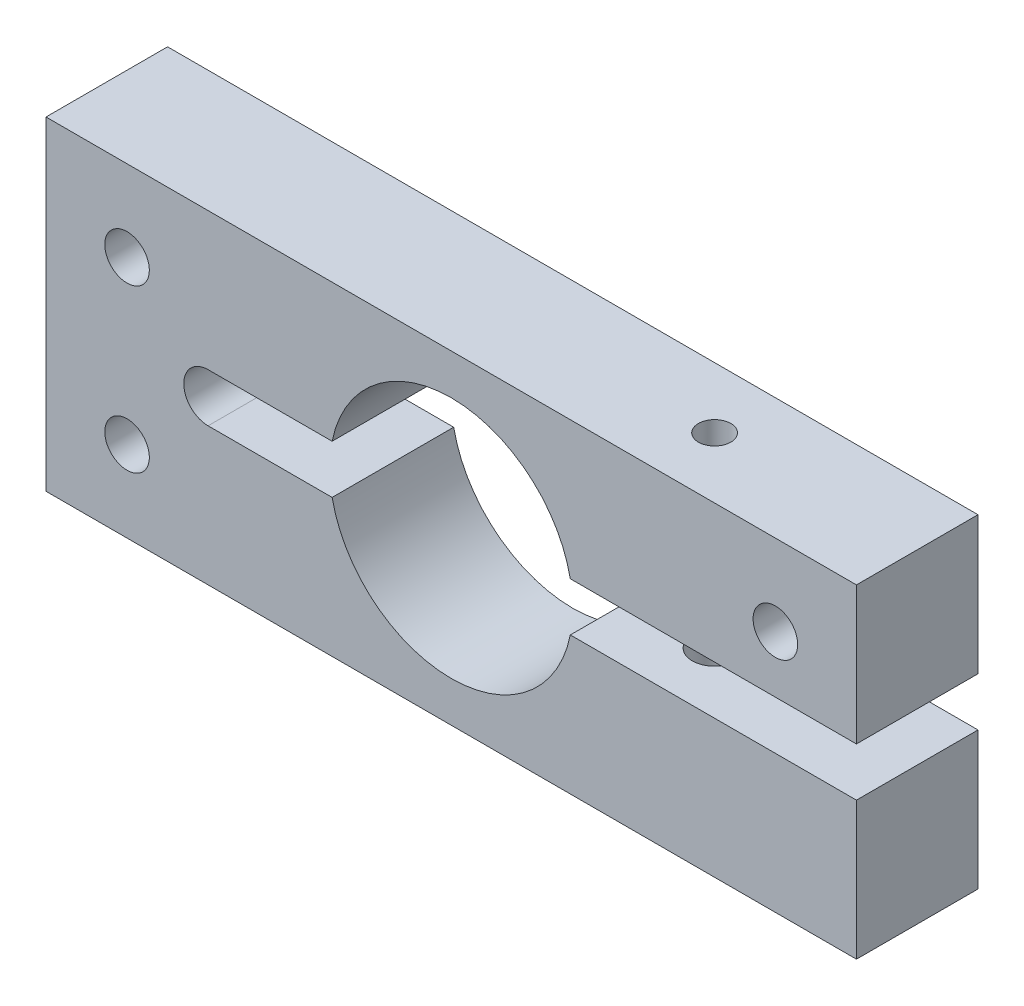
ISO-10303-21;
HEADER;
FILE_DESCRIPTION(('STEP AP214'),'2;1');
FILE_NAME('part.step','',(''),(''),'','','');
FILE_SCHEMA(('AUTOMOTIVE_DESIGN { 1 0 10303 214 1 1 1 1 }'));
ENDSEC;
DATA;
#1=APPLICATION_CONTEXT('core data for automotive mechanical design processes');
#2=APPLICATION_PROTOCOL_DEFINITION('international standard','automotive_design',2000,#1);
#3=PRODUCT_CONTEXT('',#1,'mechanical');
#4=PRODUCT('Part','Part','',(#3));
#5=PRODUCT_RELATED_PRODUCT_CATEGORY('part','',(#4));
#6=PRODUCT_DEFINITION_FORMATION('','',#4);
#7=PRODUCT_DEFINITION_CONTEXT('part definition',#1,'design');
#8=PRODUCT_DEFINITION('design','',#6,#7);
#9=PRODUCT_DEFINITION_SHAPE('','',#8);
#10=(LENGTH_UNIT() NAMED_UNIT(*) SI_UNIT(.MILLI.,.METRE.));
#11=(NAMED_UNIT(*) PLANE_ANGLE_UNIT() SI_UNIT($,.RADIAN.));
#12=(NAMED_UNIT(*) SI_UNIT($,.STERADIAN.) SOLID_ANGLE_UNIT());
#13=UNCERTAINTY_MEASURE_WITH_UNIT(LENGTH_MEASURE(1.E-05),#10,'distance_accuracy_value','');
#14=(GEOMETRIC_REPRESENTATION_CONTEXT(3) GLOBAL_UNCERTAINTY_ASSIGNED_CONTEXT((#13)) GLOBAL_UNIT_ASSIGNED_CONTEXT((#10,
#11,#12)) REPRESENTATION_CONTEXT('',''));
#15=CARTESIAN_POINT('',(0.,0.,0.));
#16=DIRECTION('',(0.,0.,1.));
#17=DIRECTION('',(1.,0.,0.));
#18=AXIS2_PLACEMENT_3D('',#15,#16,#17);
#19=CARTESIAN_POINT('',(50.,20.,0.));
#20=DIRECTION('',(0.,0.,1.));
#21=DIRECTION('',(1.,0.,0.));
#22=AXIS2_PLACEMENT_3D('',#19,#20,#21);
#23=PLANE('',#22);
#24=CARTESIAN_POINT('',(10.,30.,0.));
#25=DIRECTION('',(0.,0.,1.));
#26=DIRECTION('',(-1.,0.,0.));
#27=AXIS2_PLACEMENT_3D('',#24,#25,#26);
#28=CIRCLE('',#27,4.5);
#29=CARTESIAN_POINT('',(5.5,30.,0.));
#30=VERTEX_POINT('',#29);
#31=EDGE_CURVE('E221',#30,#30,#28,.T.);
#32=ORIENTED_EDGE('',*,*,#31,.T.);
#33=EDGE_LOOP('',(#32));
#34=FACE_BOUND('',#33,.T.);
#35=DIRECTION('',(0.,-1.,0.));
#36=VECTOR('',#35,1.);
#37=CARTESIAN_POINT('',(0.,0.,0.));
#38=LINE('',#37,#36);
#39=CARTESIAN_POINT('',(0.,40.,0.));
#40=VERTEX_POINT('',#39);
#41=CARTESIAN_POINT('',(0.,0.,0.));
#42=VERTEX_POINT('',#41);
#43=EDGE_CURVE('E161',#40,#42,#38,.T.);
#44=ORIENTED_EDGE('',*,*,#43,.F.);
#45=DIRECTION('',(-1.,0.,0.));
#46=VECTOR('',#45,1.);
#47=CARTESIAN_POINT('',(0.,40.,0.));
#48=LINE('',#47,#46);
#49=CARTESIAN_POINT('',(100.,40.,0.));
#50=VERTEX_POINT('',#49);
#51=EDGE_CURVE('E103',#50,#40,#48,.T.);
#52=ORIENTED_EDGE('',*,*,#51,.F.);
#53=DIRECTION('',(0.,1.,0.));
#54=VECTOR('',#53,1.);
#55=CARTESIAN_POINT('',(100.,23.,0.));
#56=LINE('',#55,#54);
#57=CARTESIAN_POINT('',(100.,23.,0.));
#58=VERTEX_POINT('',#57);
#59=EDGE_CURVE('E97',#58,#50,#56,.T.);
#60=ORIENTED_EDGE('',*,*,#59,.F.);
#61=DIRECTION('',(1.,0.,0.));
#62=VECTOR('',#61,1.);
#63=CARTESIAN_POINT('',(64.6969384566991,23.,0.));
#64=LINE('',#63,#62);
#65=CARTESIAN_POINT('',(64.6969384566991,23.,0.));
#66=VERTEX_POINT('',#65);
#67=EDGE_CURVE('E151',#66,#58,#64,.T.);
#68=ORIENTED_EDGE('',*,*,#67,.F.);
#69=CARTESIAN_POINT('',(50.,20.,0.));
#70=DIRECTION('',(0.,0.,-1.));
#71=DIRECTION('',(1.,0.,0.));
#72=AXIS2_PLACEMENT_3D('',#69,#70,#71);
#73=CIRCLE('',#72,15.);
#74=CARTESIAN_POINT('',(35.3030615433009,23.,0.));
#75=VERTEX_POINT('',#74);
#76=EDGE_CURVE('E179',#75,#66,#73,.T.);
#77=ORIENTED_EDGE('',*,*,#76,.F.);
#78=DIRECTION('',(1.,0.,0.));
#79=VECTOR('',#78,1.);
#80=CARTESIAN_POINT('',(20.,23.,0.));
#81=LINE('',#80,#79);
#82=CARTESIAN_POINT('',(20.,23.,0.));
#83=VERTEX_POINT('',#82);
#84=EDGE_CURVE('E177',#83,#75,#81,.T.);
#85=ORIENTED_EDGE('',*,*,#84,.F.);
#86=CARTESIAN_POINT('',(20.,20.,0.));
#87=DIRECTION('',(0.,0.,-1.));
#88=DIRECTION('',(1.,0.,0.));
#89=AXIS2_PLACEMENT_3D('',#86,#87,#88);
#90=CIRCLE('',#89,3.);
#91=CARTESIAN_POINT('',(20.,17.,0.));
#92=VERTEX_POINT('',#91);
#93=EDGE_CURVE('E175',#92,#83,#90,.T.);
#94=ORIENTED_EDGE('',*,*,#93,.F.);
#95=DIRECTION('',(-1.,0.,0.));
#96=VECTOR('',#95,1.);
#97=CARTESIAN_POINT('',(20.,17.,0.));
#98=LINE('',#97,#96);
#99=CARTESIAN_POINT('',(35.3030615433009,17.,0.));
#100=VERTEX_POINT('',#99);
#101=EDGE_CURVE('E173',#100,#92,#98,.T.);
#102=ORIENTED_EDGE('',*,*,#101,.F.);
#103=CARTESIAN_POINT('',(50.,20.,0.));
#104=DIRECTION('',(0.,0.,-1.));
#105=DIRECTION('',(1.,0.,0.));
#106=AXIS2_PLACEMENT_3D('',#103,#104,#105);
#107=CIRCLE('',#106,15.);
#108=CARTESIAN_POINT('',(64.6969384566991,17.,0.));
#109=VERTEX_POINT('',#108);
#110=EDGE_CURVE('E171',#109,#100,#107,.T.);
#111=ORIENTED_EDGE('',*,*,#110,.F.);
#112=DIRECTION('',(-1.,0.,0.));
#113=VECTOR('',#112,1.);
#114=CARTESIAN_POINT('',(64.6969384566991,17.,0.));
#115=LINE('',#114,#113);
#116=CARTESIAN_POINT('',(100.,17.,0.));
#117=VERTEX_POINT('',#116);
#118=EDGE_CURVE('E169',#117,#109,#115,.T.);
#119=ORIENTED_EDGE('',*,*,#118,.F.);
#120=DIRECTION('',(0.,1.,0.));
#121=VECTOR('',#120,1.);
#122=CARTESIAN_POINT('',(100.,0.,0.));
#123=LINE('',#122,#121);
#124=CARTESIAN_POINT('',(100.,0.,0.));
#125=VERTEX_POINT('',#124);
#126=EDGE_CURVE('E167',#125,#117,#123,.T.);
#127=ORIENTED_EDGE('',*,*,#126,.F.);
#128=DIRECTION('',(1.,0.,0.));
#129=VECTOR('',#128,1.);
#130=CARTESIAN_POINT('',(0.,0.,0.));
#131=LINE('',#130,#129);
#132=EDGE_CURVE('E164',#42,#125,#131,.T.);
#133=ORIENTED_EDGE('',*,*,#132,.F.);
#134=EDGE_LOOP('',(#44,#52,#60,#68,#77,#85,#94,#102,#111,#119,#127,#133));
#135=FACE_BOUND('',#134,.T.);
#136=CARTESIAN_POINT('',(10.,10.,0.));
#137=DIRECTION('',(0.,0.,1.));
#138=DIRECTION('',(1.,0.,0.));
#139=AXIS2_PLACEMENT_3D('',#136,#137,#138);
#140=CIRCLE('',#139,4.5);
#141=CARTESIAN_POINT('',(14.5,10.,0.));
#142=VERTEX_POINT('',#141);
#143=EDGE_CURVE('E214',#142,#142,#140,.T.);
#144=ORIENTED_EDGE('',*,*,#143,.T.);
#145=EDGE_LOOP('',(#144));
#146=FACE_BOUND('',#145,.T.);
#147=CARTESIAN_POINT('',(90.,30.,0.));
#148=DIRECTION('',(0.,0.,1.));
#149=DIRECTION('',(1.,0.,0.));
#150=AXIS2_PLACEMENT_3D('',#147,#148,#149);
#151=CIRCLE('',#150,4.49999999999999);
#152=CARTESIAN_POINT('',(94.5,30.,0.));
#153=VERTEX_POINT('',#152);
#154=EDGE_CURVE('E228',#153,#153,#151,.T.);
#155=ORIENTED_EDGE('',*,*,#154,.T.);
#156=EDGE_LOOP('',(#155));
#157=FACE_BOUND('',#156,.T.);
#158=ADVANCED_FACE('F37',(#34,#135,#146,#157),#23,.F.);
#159=CARTESIAN_POINT('',(10.,30.,15.));
#160=DIRECTION('',(0.,0.,-1.));
#161=DIRECTION('',(-1.,0.,0.));
#162=AXIS2_PLACEMENT_3D('',#159,#160,#161);
#163=CYLINDRICAL_SURFACE('',#162,2.75);
#164=CARTESIAN_POINT('',(10.,30.,15.));
#165=DIRECTION('',(0.,0.,1.));
#166=DIRECTION('',(1.,0.,0.));
#167=AXIS2_PLACEMENT_3D('',#164,#165,#166);
#168=CIRCLE('',#167,2.75);
#169=CARTESIAN_POINT('',(12.75,30.,15.));
#170=VERTEX_POINT('',#169);
#171=EDGE_CURVE('E165',#170,#170,#168,.T.);
#172=ORIENTED_EDGE('',*,*,#171,.T.);
#173=EDGE_LOOP('',(#172));
#174=FACE_BOUND('',#173,.T.);
#175=CARTESIAN_POINT('',(10.,30.,5.));
#176=DIRECTION('',(0.,0.,-1.));
#177=DIRECTION('',(-1.,0.,0.));
#178=AXIS2_PLACEMENT_3D('',#175,#176,#177);
#179=CIRCLE('',#178,2.75);
#180=CARTESIAN_POINT('',(7.25,30.,5.));
#181=VERTEX_POINT('',#180);
#182=EDGE_CURVE('E212',#181,#181,#179,.T.);
#183=ORIENTED_EDGE('',*,*,#182,.T.);
#184=EDGE_LOOP('',(#183));
#185=FACE_BOUND('',#184,.T.);
#186=ADVANCED_FACE('F297',(#174,#185),#163,.F.);
#187=CARTESIAN_POINT('',(50.,20.,15.));
#188=DIRECTION('',(0.,0.,1.));
#189=DIRECTION('',(1.,0.,0.));
#190=AXIS2_PLACEMENT_3D('',#187,#188,#189);
#191=PLANE('',#190);
#192=CARTESIAN_POINT('',(10.,10.,15.));
#193=DIRECTION('',(0.,0.,1.));
#194=DIRECTION('',(-1.,0.,0.));
#195=AXIS2_PLACEMENT_3D('',#192,#193,#194);
#196=CIRCLE('',#195,2.75);
#197=CARTESIAN_POINT('',(7.25,10.,15.));
#198=VERTEX_POINT('',#197);
#199=EDGE_CURVE('E247',#198,#198,#196,.T.);
#200=ORIENTED_EDGE('',*,*,#199,.F.);
#201=EDGE_LOOP('',(#200));
#202=FACE_BOUND('',#201,.T.);
#203=DIRECTION('',(0.,-1.,0.));
#204=VECTOR('',#203,1.);
#205=CARTESIAN_POINT('',(0.,0.,15.));
#206=LINE('',#205,#204);
#207=CARTESIAN_POINT('',(0.,40.,15.));
#208=VERTEX_POINT('',#207);
#209=CARTESIAN_POINT('',(0.,0.,15.));
#210=VERTEX_POINT('',#209);
#211=EDGE_CURVE('E184',#208,#210,#206,.T.);
#212=ORIENTED_EDGE('',*,*,#211,.T.);
#213=DIRECTION('',(1.,0.,0.));
#214=VECTOR('',#213,1.);
#215=CARTESIAN_POINT('',(0.,0.,15.));
#216=LINE('',#215,#214);
#217=CARTESIAN_POINT('',(100.,0.,15.));
#218=VERTEX_POINT('',#217);
#219=EDGE_CURVE('E111',#210,#218,#216,.T.);
#220=ORIENTED_EDGE('',*,*,#219,.T.);
#221=DIRECTION('',(0.,1.,0.));
#222=VECTOR('',#221,1.);
#223=CARTESIAN_POINT('',(100.,0.,15.));
#224=LINE('',#223,#222);
#225=CARTESIAN_POINT('',(100.,17.,15.));
#226=VERTEX_POINT('',#225);
#227=EDGE_CURVE('E254',#218,#226,#224,.T.);
#228=ORIENTED_EDGE('',*,*,#227,.T.);
#229=DIRECTION('',(-1.,0.,0.));
#230=VECTOR('',#229,1.);
#231=CARTESIAN_POINT('',(64.6969384566991,17.,15.));
#232=LINE('',#231,#230);
#233=CARTESIAN_POINT('',(64.6969384566991,17.,15.));
#234=VERTEX_POINT('',#233);
#235=EDGE_CURVE('E256',#226,#234,#232,.T.);
#236=ORIENTED_EDGE('',*,*,#235,.T.);
#237=CARTESIAN_POINT('',(50.,20.,15.));
#238=DIRECTION('',(0.,0.,-1.));
#239=DIRECTION('',(1.,0.,0.));
#240=AXIS2_PLACEMENT_3D('',#237,#238,#239);
#241=CIRCLE('',#240,15.);
#242=CARTESIAN_POINT('',(35.3030615433009,17.,15.));
#243=VERTEX_POINT('',#242);
#244=EDGE_CURVE('E258',#234,#243,#241,.T.);
#245=ORIENTED_EDGE('',*,*,#244,.T.);
#246=DIRECTION('',(-1.,0.,0.));
#247=VECTOR('',#246,1.);
#248=CARTESIAN_POINT('',(20.,17.,15.));
#249=LINE('',#248,#247);
#250=CARTESIAN_POINT('',(20.,17.,15.));
#251=VERTEX_POINT('',#250);
#252=EDGE_CURVE('E260',#243,#251,#249,.T.);
#253=ORIENTED_EDGE('',*,*,#252,.T.);
#254=CARTESIAN_POINT('',(20.,20.,15.));
#255=DIRECTION('',(0.,0.,-1.));
#256=DIRECTION('',(1.,0.,0.));
#257=AXIS2_PLACEMENT_3D('',#254,#255,#256);
#258=CIRCLE('',#257,3.);
#259=CARTESIAN_POINT('',(20.,23.,15.));
#260=VERTEX_POINT('',#259);
#261=EDGE_CURVE('E262',#251,#260,#258,.T.);
#262=ORIENTED_EDGE('',*,*,#261,.T.);
#263=DIRECTION('',(1.,0.,0.));
#264=VECTOR('',#263,1.);
#265=CARTESIAN_POINT('',(20.,23.,15.));
#266=LINE('',#265,#264);
#267=CARTESIAN_POINT('',(35.3030615433009,23.,15.));
#268=VERTEX_POINT('',#267);
#269=EDGE_CURVE('E264',#260,#268,#266,.T.);
#270=ORIENTED_EDGE('',*,*,#269,.T.);
#271=CARTESIAN_POINT('',(50.,20.,15.));
#272=DIRECTION('',(0.,0.,-1.));
#273=DIRECTION('',(1.,0.,0.));
#274=AXIS2_PLACEMENT_3D('',#271,#272,#273);
#275=CIRCLE('',#274,15.);
#276=CARTESIAN_POINT('',(64.6969384566991,23.,15.));
#277=VERTEX_POINT('',#276);
#278=EDGE_CURVE('E143',#268,#277,#275,.T.);
#279=ORIENTED_EDGE('',*,*,#278,.T.);
#280=DIRECTION('',(1.,0.,0.));
#281=VECTOR('',#280,1.);
#282=CARTESIAN_POINT('',(64.6969384566991,23.,15.));
#283=LINE('',#282,#281);
#284=CARTESIAN_POINT('',(100.,23.,15.));
#285=VERTEX_POINT('',#284);
#286=EDGE_CURVE('E136',#277,#285,#283,.T.);
#287=ORIENTED_EDGE('',*,*,#286,.T.);
#288=DIRECTION('',(0.,1.,0.));
#289=VECTOR('',#288,1.);
#290=CARTESIAN_POINT('',(100.,23.,15.));
#291=LINE('',#290,#289);
#292=CARTESIAN_POINT('',(100.,40.,15.));
#293=VERTEX_POINT('',#292);
#294=EDGE_CURVE('E141',#285,#293,#291,.T.);
#295=ORIENTED_EDGE('',*,*,#294,.T.);
#296=DIRECTION('',(-1.,0.,0.));
#297=VECTOR('',#296,1.);
#298=CARTESIAN_POINT('',(0.,40.,15.));
#299=LINE('',#298,#297);
#300=EDGE_CURVE('E56',#293,#208,#299,.T.);
#301=ORIENTED_EDGE('',*,*,#300,.T.);
#302=EDGE_LOOP('',(#212,#220,#228,#236,#245,#253,#262,#270,#279,#287,#295,#301));
#303=FACE_BOUND('',#302,.T.);
#304=ORIENTED_EDGE('',*,*,#171,.F.);
#305=EDGE_LOOP('',(#304));
#306=FACE_BOUND('',#305,.T.);
#307=CARTESIAN_POINT('',(90.,30.,15.));
#308=DIRECTION('',(0.,0.,1.));
#309=DIRECTION('',(-1.,0.,0.));
#310=AXIS2_PLACEMENT_3D('',#307,#308,#309);
#311=CIRCLE('',#310,2.74999999999999);
#312=CARTESIAN_POINT('',(87.25,30.,15.));
#313=VERTEX_POINT('',#312);
#314=EDGE_CURVE('E244',#313,#313,#311,.T.);
#315=ORIENTED_EDGE('',*,*,#314,.F.);
#316=EDGE_LOOP('',(#315));
#317=FACE_BOUND('',#316,.T.);
#318=ADVANCED_FACE('F138',(#202,#303,#306,#317),#191,.T.);
#319=CARTESIAN_POINT('',(0.,0.,15.));
#320=DIRECTION('',(1.,0.,0.));
#321=DIRECTION('',(0.,0.,-1.));
#322=AXIS2_PLACEMENT_3D('',#319,#320,#321);
#323=PLANE('',#322);
#324=ORIENTED_EDGE('',*,*,#43,.T.);
#325=DIRECTION('',(0.,0.,-1.));
#326=VECTOR('',#325,1.);
#327=CARTESIAN_POINT('',(0.,0.,15.));
#328=LINE('',#327,#326);
#329=EDGE_CURVE('E11',#210,#42,#328,.T.);
#330=ORIENTED_EDGE('',*,*,#329,.F.);
#331=ORIENTED_EDGE('',*,*,#211,.F.);
#332=DIRECTION('',(0.,0.,-1.));
#333=VECTOR('',#332,1.);
#334=CARTESIAN_POINT('',(0.,40.,15.));
#335=LINE('',#334,#333);
#336=EDGE_CURVE('E157',#208,#40,#335,.T.);
#337=ORIENTED_EDGE('',*,*,#336,.T.);
#338=EDGE_LOOP('',(#324,#330,#331,#337));
#339=FACE_BOUND('',#338,.T.);
#340=ADVANCED_FACE('F39',(#339),#323,.F.);
#341=CARTESIAN_POINT('',(0.,0.,15.));
#342=DIRECTION('',(0.,1.,0.));
#343=DIRECTION('',(0.,0.,1.));
#344=AXIS2_PLACEMENT_3D('',#341,#342,#343);
#345=PLANE('',#344);
#346=CARTESIAN_POINT('',(75.,0.,7.5));
#347=DIRECTION('',(0.,-1.,0.));
#348=DIRECTION('',(0.,0.,-1.));
#349=AXIS2_PLACEMENT_3D('',#346,#347,#348);
#350=CIRCLE('',#349,4.5);
#351=CARTESIAN_POINT('',(75.,0.,2.99999999999999));
#352=VERTEX_POINT('',#351);
#353=EDGE_CURVE('E210',#352,#352,#350,.T.);
#354=ORIENTED_EDGE('',*,*,#353,.F.);
#355=EDGE_LOOP('',(#354));
#356=FACE_BOUND('',#355,.T.);
#357=ORIENTED_EDGE('',*,*,#132,.T.);
#358=DIRECTION('',(0.,0.,-1.));
#359=VECTOR('',#358,1.);
#360=CARTESIAN_POINT('',(100.,0.,15.));
#361=LINE('',#360,#359);
#362=EDGE_CURVE('E47',#218,#125,#361,.T.);
#363=ORIENTED_EDGE('',*,*,#362,.F.);
#364=ORIENTED_EDGE('',*,*,#219,.F.);
#365=ORIENTED_EDGE('',*,*,#329,.T.);
#366=EDGE_LOOP('',(#357,#363,#364,#365));
#367=FACE_BOUND('',#366,.T.);
#368=ADVANCED_FACE('F409',(#356,#367),#345,.F.);
#369=CARTESIAN_POINT('',(100.,0.,15.));
#370=DIRECTION('',(-1.,0.,0.));
#371=DIRECTION('',(0.,0.,1.));
#372=AXIS2_PLACEMENT_3D('',#369,#370,#371);
#373=PLANE('',#372);
#374=ORIENTED_EDGE('',*,*,#126,.T.);
#375=DIRECTION('',(0.,0.,-1.));
#376=VECTOR('',#375,1.);
#377=CARTESIAN_POINT('',(100.,17.,15.));
#378=LINE('',#377,#376);
#379=EDGE_CURVE('E203',#226,#117,#378,.T.);
#380=ORIENTED_EDGE('',*,*,#379,.F.);
#381=ORIENTED_EDGE('',*,*,#227,.F.);
#382=ORIENTED_EDGE('',*,*,#362,.T.);
#383=EDGE_LOOP('',(#374,#380,#381,#382));
#384=FACE_BOUND('',#383,.T.);
#385=ADVANCED_FACE('F378',(#384),#373,.F.);
#386=CARTESIAN_POINT('',(64.6969384566991,17.,15.));
#387=DIRECTION('',(0.,-1.,0.));
#388=DIRECTION('',(0.,0.,-1.));
#389=AXIS2_PLACEMENT_3D('',#386,#387,#388);
#390=PLANE('',#389);
#391=CARTESIAN_POINT('',(75.,17.,7.5));
#392=DIRECTION('',(0.,-1.,0.));
#393=DIRECTION('',(0.,0.,-1.));
#394=AXIS2_PLACEMENT_3D('',#391,#392,#393);
#395=CIRCLE('',#394,2.75000000000001);
#396=CARTESIAN_POINT('',(75.,17.,4.74999999999999));
#397=VERTEX_POINT('',#396);
#398=EDGE_CURVE('E357',#397,#397,#395,.F.);
#399=ORIENTED_EDGE('',*,*,#398,.F.);
#400=EDGE_LOOP('',(#399));
#401=FACE_BOUND('',#400,.T.);
#402=ORIENTED_EDGE('',*,*,#118,.T.);
#403=DIRECTION('',(0.,0.,-1.));
#404=VECTOR('',#403,1.);
#405=CARTESIAN_POINT('',(64.6969384566991,17.,15.));
#406=LINE('',#405,#404);
#407=EDGE_CURVE('E200',#234,#109,#406,.T.);
#408=ORIENTED_EDGE('',*,*,#407,.F.);
#409=ORIENTED_EDGE('',*,*,#235,.F.);
#410=ORIENTED_EDGE('',*,*,#379,.T.);
#411=EDGE_LOOP('',(#402,#408,#409,#410));
#412=FACE_BOUND('',#411,.T.);
#413=ADVANCED_FACE('F374',(#401,#412),#390,.F.);
#414=CARTESIAN_POINT('',(50.,20.,15.));
#415=DIRECTION('',(0.,0.,-1.));
#416=DIRECTION('',(-1.,0.,0.));
#417=AXIS2_PLACEMENT_3D('',#414,#415,#416);
#418=CYLINDRICAL_SURFACE('',#417,15.);
#419=ORIENTED_EDGE('',*,*,#110,.T.);
#420=DIRECTION('',(0.,0.,-1.));
#421=VECTOR('',#420,1.);
#422=CARTESIAN_POINT('',(35.3030615433009,17.,15.));
#423=LINE('',#422,#421);
#424=EDGE_CURVE('E197',#243,#100,#423,.T.);
#425=ORIENTED_EDGE('',*,*,#424,.F.);
#426=ORIENTED_EDGE('',*,*,#244,.F.);
#427=ORIENTED_EDGE('',*,*,#407,.T.);
#428=EDGE_LOOP('',(#419,#425,#426,#427));
#429=FACE_BOUND('',#428,.T.);
#430=ADVANCED_FACE('F377',(#429),#418,.F.);
#431=CARTESIAN_POINT('',(20.,17.,15.));
#432=DIRECTION('',(0.,-1.,0.));
#433=DIRECTION('',(0.,0.,-1.));
#434=AXIS2_PLACEMENT_3D('',#431,#432,#433);
#435=PLANE('',#434);
#436=ORIENTED_EDGE('',*,*,#101,.T.);
#437=DIRECTION('',(0.,0.,-1.));
#438=VECTOR('',#437,1.);
#439=CARTESIAN_POINT('',(20.,17.,15.));
#440=LINE('',#439,#438);
#441=EDGE_CURVE('E194',#251,#92,#440,.T.);
#442=ORIENTED_EDGE('',*,*,#441,.F.);
#443=ORIENTED_EDGE('',*,*,#252,.F.);
#444=ORIENTED_EDGE('',*,*,#424,.T.);
#445=EDGE_LOOP('',(#436,#442,#443,#444));
#446=FACE_BOUND('',#445,.T.);
#447=ADVANCED_FACE('F392',(#446),#435,.F.);
#448=CARTESIAN_POINT('',(20.,20.,15.));
#449=DIRECTION('',(0.,0.,-1.));
#450=DIRECTION('',(-1.,0.,0.));
#451=AXIS2_PLACEMENT_3D('',#448,#449,#450);
#452=CYLINDRICAL_SURFACE('',#451,3.);
#453=ORIENTED_EDGE('',*,*,#93,.T.);
#454=DIRECTION('',(0.,0.,-1.));
#455=VECTOR('',#454,1.);
#456=CARTESIAN_POINT('',(20.,23.,15.));
#457=LINE('',#456,#455);
#458=EDGE_CURVE('E191',#260,#83,#457,.T.);
#459=ORIENTED_EDGE('',*,*,#458,.F.);
#460=ORIENTED_EDGE('',*,*,#261,.F.);
#461=ORIENTED_EDGE('',*,*,#441,.T.);
#462=EDGE_LOOP('',(#453,#459,#460,#461));
#463=FACE_BOUND('',#462,.T.);
#464=ADVANCED_FACE('F395',(#463),#452,.F.);
#465=CARTESIAN_POINT('',(20.,23.,15.));
#466=DIRECTION('',(0.,1.,0.));
#467=DIRECTION('',(0.,0.,1.));
#468=AXIS2_PLACEMENT_3D('',#465,#466,#467);
#469=PLANE('',#468);
#470=ORIENTED_EDGE('',*,*,#84,.T.);
#471=DIRECTION('',(0.,0.,-1.));
#472=VECTOR('',#471,1.);
#473=CARTESIAN_POINT('',(35.3030615433009,23.,15.));
#474=LINE('',#473,#472);
#475=EDGE_CURVE('E188',#268,#75,#474,.T.);
#476=ORIENTED_EDGE('',*,*,#475,.F.);
#477=ORIENTED_EDGE('',*,*,#269,.F.);
#478=ORIENTED_EDGE('',*,*,#458,.T.);
#479=EDGE_LOOP('',(#470,#476,#477,#478));
#480=FACE_BOUND('',#479,.T.);
#481=ADVANCED_FACE('F270',(#480),#469,.F.);
#482=CARTESIAN_POINT('',(50.,20.,15.));
#483=DIRECTION('',(0.,0.,-1.));
#484=DIRECTION('',(-1.,0.,0.));
#485=AXIS2_PLACEMENT_3D('',#482,#483,#484);
#486=CYLINDRICAL_SURFACE('',#485,15.);
#487=ORIENTED_EDGE('',*,*,#76,.T.);
#488=DIRECTION('',(0.,0.,-1.));
#489=VECTOR('',#488,1.);
#490=CARTESIAN_POINT('',(64.6969384566991,23.,15.));
#491=LINE('',#490,#489);
#492=EDGE_CURVE('E152',#277,#66,#491,.T.);
#493=ORIENTED_EDGE('',*,*,#492,.F.);
#494=ORIENTED_EDGE('',*,*,#278,.F.);
#495=ORIENTED_EDGE('',*,*,#475,.T.);
#496=EDGE_LOOP('',(#487,#493,#494,#495));
#497=FACE_BOUND('',#496,.T.);
#498=ADVANCED_FACE('F274',(#497),#486,.F.);
#499=CARTESIAN_POINT('',(64.6969384566991,23.,15.));
#500=DIRECTION('',(0.,1.,0.));
#501=DIRECTION('',(-1.,0.,0.));
#502=AXIS2_PLACEMENT_3D('',#499,#500,#501);
#503=PLANE('',#502);
#504=CARTESIAN_POINT('',(75.,23.,7.5));
#505=DIRECTION('',(0.,1.,0.));
#506=DIRECTION('',(-1.,0.,0.));
#507=AXIS2_PLACEMENT_3D('',#504,#505,#506);
#508=CIRCLE('',#507,2.);
#509=CARTESIAN_POINT('',(73.,23.,7.5));
#510=VERTEX_POINT('',#509);
#511=EDGE_CURVE('E241',#510,#510,#508,.T.);
#512=ORIENTED_EDGE('',*,*,#511,.T.);
#513=EDGE_LOOP('',(#512));
#514=FACE_BOUND('',#513,.T.);
#515=ORIENTED_EDGE('',*,*,#67,.T.);
#516=DIRECTION('',(0.,0.,-1.));
#517=VECTOR('',#516,1.);
#518=CARTESIAN_POINT('',(100.,23.,15.));
#519=LINE('',#518,#517);
#520=EDGE_CURVE('E148',#285,#58,#519,.T.);
#521=ORIENTED_EDGE('',*,*,#520,.F.);
#522=ORIENTED_EDGE('',*,*,#286,.F.);
#523=ORIENTED_EDGE('',*,*,#492,.T.);
#524=EDGE_LOOP('',(#515,#521,#522,#523));
#525=FACE_BOUND('',#524,.T.);
#526=ADVANCED_FACE('F149',(#514,#525),#503,.F.);
#527=CARTESIAN_POINT('',(100.,23.,15.));
#528=DIRECTION('',(-1.,0.,0.));
#529=DIRECTION('',(0.,0.,1.));
#530=AXIS2_PLACEMENT_3D('',#527,#528,#529);
#531=PLANE('',#530);
#532=ORIENTED_EDGE('',*,*,#59,.T.);
#533=DIRECTION('',(0.,0.,-1.));
#534=VECTOR('',#533,1.);
#535=CARTESIAN_POINT('',(100.,40.,15.));
#536=LINE('',#535,#534);
#537=EDGE_CURVE('E153',#293,#50,#536,.T.);
#538=ORIENTED_EDGE('',*,*,#537,.F.);
#539=ORIENTED_EDGE('',*,*,#294,.F.);
#540=ORIENTED_EDGE('',*,*,#520,.T.);
#541=EDGE_LOOP('',(#532,#538,#539,#540));
#542=FACE_BOUND('',#541,.T.);
#543=ADVANCED_FACE('F155',(#542),#531,.F.);
#544=CARTESIAN_POINT('',(0.,40.,15.));
#545=DIRECTION('',(0.,-1.,0.));
#546=DIRECTION('',(0.,0.,-1.));
#547=AXIS2_PLACEMENT_3D('',#544,#545,#546);
#548=PLANE('',#547);
#549=CARTESIAN_POINT('',(75.,40.,7.5));
#550=DIRECTION('',(0.,-1.,0.));
#551=DIRECTION('',(0.,0.,-1.));
#552=AXIS2_PLACEMENT_3D('',#549,#550,#551);
#553=CIRCLE('',#552,2.);
#554=CARTESIAN_POINT('',(75.,40.,5.5));
#555=VERTEX_POINT('',#554);
#556=EDGE_CURVE('E236',#555,#555,#553,.T.);
#557=ORIENTED_EDGE('',*,*,#556,.T.);
#558=EDGE_LOOP('',(#557));
#559=FACE_BOUND('',#558,.T.);
#560=ORIENTED_EDGE('',*,*,#51,.T.);
#561=ORIENTED_EDGE('',*,*,#336,.F.);
#562=ORIENTED_EDGE('',*,*,#300,.F.);
#563=ORIENTED_EDGE('',*,*,#537,.T.);
#564=EDGE_LOOP('',(#560,#561,#562,#563));
#565=FACE_BOUND('',#564,.T.);
#566=ADVANCED_FACE('F282',(#559,#565),#548,.F.);
#567=CARTESIAN_POINT('',(10.,10.,15.));
#568=DIRECTION('',(0.,0.,-1.));
#569=DIRECTION('',(-1.,0.,0.));
#570=AXIS2_PLACEMENT_3D('',#567,#568,#569);
#571=CYLINDRICAL_SURFACE('',#570,2.75);
#572=CARTESIAN_POINT('',(10.,10.,5.));
#573=DIRECTION('',(0.,0.,1.));
#574=DIRECTION('',(1.,0.,0.));
#575=AXIS2_PLACEMENT_3D('',#572,#573,#574);
#576=CIRCLE('',#575,2.75);
#577=CARTESIAN_POINT('',(12.75,10.,5.));
#578=VERTEX_POINT('',#577);
#579=EDGE_CURVE('E208',#578,#578,#576,.T.);
#580=ORIENTED_EDGE('',*,*,#579,.F.);
#581=EDGE_LOOP('',(#580));
#582=FACE_BOUND('',#581,.T.);
#583=ORIENTED_EDGE('',*,*,#199,.T.);
#584=EDGE_LOOP('',(#583));
#585=FACE_BOUND('',#584,.T.);
#586=ADVANCED_FACE('F284',(#582,#585),#571,.F.);
#587=CARTESIAN_POINT('',(90.,30.,15.));
#588=DIRECTION('',(0.,0.,-1.));
#589=DIRECTION('',(-1.,0.,0.));
#590=AXIS2_PLACEMENT_3D('',#587,#588,#589);
#591=CYLINDRICAL_SURFACE('',#590,2.74999999999999);
#592=CARTESIAN_POINT('',(90.,30.,5.));
#593=DIRECTION('',(0.,0.,1.));
#594=DIRECTION('',(1.,0.,0.));
#595=AXIS2_PLACEMENT_3D('',#592,#593,#594);
#596=CIRCLE('',#595,2.74999999999999);
#597=CARTESIAN_POINT('',(92.75,30.,5.));
#598=VERTEX_POINT('',#597);
#599=EDGE_CURVE('E41',#598,#598,#596,.T.);
#600=ORIENTED_EDGE('',*,*,#599,.F.);
#601=EDGE_LOOP('',(#600));
#602=FACE_BOUND('',#601,.T.);
#603=ORIENTED_EDGE('',*,*,#314,.T.);
#604=EDGE_LOOP('',(#603));
#605=FACE_BOUND('',#604,.T.);
#606=ADVANCED_FACE('F291',(#602,#605),#591,.F.);
#607=CARTESIAN_POINT('',(75.,40.,7.5));
#608=DIRECTION('',(0.,-1.,0.));
#609=DIRECTION('',(0.,0.,-1.));
#610=AXIS2_PLACEMENT_3D('',#607,#608,#609);
#611=CYLINDRICAL_SURFACE('',#610,2.);
#612=ORIENTED_EDGE('',*,*,#556,.F.);
#613=EDGE_LOOP('',(#612));
#614=FACE_BOUND('',#613,.T.);
#615=ORIENTED_EDGE('',*,*,#511,.F.);
#616=EDGE_LOOP('',(#615));
#617=FACE_BOUND('',#616,.T.);
#618=ADVANCED_FACE('F310',(#614,#617),#611,.F.);
#619=CARTESIAN_POINT('',(75.,5.,7.5));
#620=DIRECTION('',(0.,-1.,0.));
#621=DIRECTION('',(0.,0.,-1.));
#622=AXIS2_PLACEMENT_3D('',#619,#620,#621);
#623=PLANE('',#622);
#624=CARTESIAN_POINT('',(75.,5.,7.5));
#625=DIRECTION('',(0.,-1.,0.));
#626=DIRECTION('',(0.,0.,-1.));
#627=AXIS2_PLACEMENT_3D('',#624,#625,#626);
#628=CIRCLE('',#627,2.75000000000001);
#629=CARTESIAN_POINT('',(75.,5.,4.74999999999999));
#630=VERTEX_POINT('',#629);
#631=EDGE_CURVE('E354',#630,#630,#628,.T.);
#632=ORIENTED_EDGE('',*,*,#631,.F.);
#633=EDGE_LOOP('',(#632));
#634=FACE_BOUND('',#633,.T.);
#635=CARTESIAN_POINT('',(75.,5.,7.5));
#636=DIRECTION('',(0.,-1.,0.));
#637=DIRECTION('',(0.,0.,-1.));
#638=AXIS2_PLACEMENT_3D('',#635,#636,#637);
#639=CIRCLE('',#638,4.5);
#640=CARTESIAN_POINT('',(75.,5.,2.99999999999999));
#641=VERTEX_POINT('',#640);
#642=EDGE_CURVE('E233',#641,#641,#639,.T.);
#643=ORIENTED_EDGE('',*,*,#642,.T.);
#644=EDGE_LOOP('',(#643));
#645=FACE_BOUND('',#644,.T.);
#646=ADVANCED_FACE('F314',(#634,#645),#623,.T.);
#647=CARTESIAN_POINT('',(75.,5.,7.5));
#648=DIRECTION('',(0.,-1.,0.));
#649=DIRECTION('',(0.,0.,-1.));
#650=AXIS2_PLACEMENT_3D('',#647,#648,#649);
#651=CYLINDRICAL_SURFACE('',#650,4.5);
#652=ORIENTED_EDGE('',*,*,#642,.F.);
#653=EDGE_LOOP('',(#652));
#654=FACE_BOUND('',#653,.T.);
#655=ORIENTED_EDGE('',*,*,#353,.T.);
#656=EDGE_LOOP('',(#655));
#657=FACE_BOUND('',#656,.T.);
#658=ADVANCED_FACE('F316',(#654,#657),#651,.F.);
#659=CARTESIAN_POINT('',(10.,10.,5.));
#660=DIRECTION('',(0.,0.,-1.));
#661=DIRECTION('',(-1.,0.,0.));
#662=AXIS2_PLACEMENT_3D('',#659,#660,#661);
#663=CYLINDRICAL_SURFACE('',#662,4.5);
#664=CARTESIAN_POINT('',(10.,10.,5.));
#665=DIRECTION('',(0.,0.,1.));
#666=DIRECTION('',(1.,0.,0.));
#667=AXIS2_PLACEMENT_3D('',#664,#665,#666);
#668=CIRCLE('',#667,4.5);
#669=CARTESIAN_POINT('',(14.5,10.,5.));
#670=VERTEX_POINT('',#669);
#671=EDGE_CURVE('E211',#670,#670,#668,.T.);
#672=ORIENTED_EDGE('',*,*,#671,.T.);
#673=EDGE_LOOP('',(#672));
#674=FACE_BOUND('',#673,.T.);
#675=ORIENTED_EDGE('',*,*,#143,.F.);
#676=EDGE_LOOP('',(#675));
#677=FACE_BOUND('',#676,.T.);
#678=ADVANCED_FACE('F319',(#674,#677),#663,.F.);
#679=CARTESIAN_POINT('',(10.,10.,5.));
#680=DIRECTION('',(0.,0.,1.));
#681=DIRECTION('',(1.,0.,0.));
#682=AXIS2_PLACEMENT_3D('',#679,#680,#681);
#683=PLANE('',#682);
#684=ORIENTED_EDGE('',*,*,#579,.T.);
#685=EDGE_LOOP('',(#684));
#686=FACE_BOUND('',#685,.T.);
#687=ORIENTED_EDGE('',*,*,#671,.F.);
#688=EDGE_LOOP('',(#687));
#689=FACE_BOUND('',#688,.T.);
#690=ADVANCED_FACE('F326',(#686,#689),#683,.F.);
#691=CARTESIAN_POINT('',(10.,30.,5.));
#692=DIRECTION('',(0.,0.,-1.));
#693=DIRECTION('',(-1.,0.,0.));
#694=AXIS2_PLACEMENT_3D('',#691,#692,#693);
#695=CYLINDRICAL_SURFACE('',#694,4.5);
#696=CARTESIAN_POINT('',(10.,30.,5.));
#697=DIRECTION('',(0.,0.,1.));
#698=DIRECTION('',(-1.,0.,0.));
#699=AXIS2_PLACEMENT_3D('',#696,#697,#698);
#700=CIRCLE('',#699,4.5);
#701=CARTESIAN_POINT('',(5.5,30.,5.));
#702=VERTEX_POINT('',#701);
#703=EDGE_CURVE('E215',#702,#702,#700,.T.);
#704=ORIENTED_EDGE('',*,*,#703,.T.);
#705=EDGE_LOOP('',(#704));
#706=FACE_BOUND('',#705,.T.);
#707=ORIENTED_EDGE('',*,*,#31,.F.);
#708=EDGE_LOOP('',(#707));
#709=FACE_BOUND('',#708,.T.);
#710=ADVANCED_FACE('F330',(#706,#709),#695,.F.);
#711=CARTESIAN_POINT('',(10.,30.,5.));
#712=DIRECTION('',(0.,0.,-1.));
#713=DIRECTION('',(-1.,0.,0.));
#714=AXIS2_PLACEMENT_3D('',#711,#712,#713);
#715=PLANE('',#714);
#716=ORIENTED_EDGE('',*,*,#182,.F.);
#717=EDGE_LOOP('',(#716));
#718=FACE_BOUND('',#717,.T.);
#719=ORIENTED_EDGE('',*,*,#703,.F.);
#720=EDGE_LOOP('',(#719));
#721=FACE_BOUND('',#720,.T.);
#722=ADVANCED_FACE('F334',(#718,#721),#715,.T.);
#723=CARTESIAN_POINT('',(90.,30.,5.));
#724=DIRECTION('',(0.,0.,-1.));
#725=DIRECTION('',(-1.,0.,0.));
#726=AXIS2_PLACEMENT_3D('',#723,#724,#725);
#727=CYLINDRICAL_SURFACE('',#726,4.49999999999999);
#728=CARTESIAN_POINT('',(90.,30.,5.));
#729=DIRECTION('',(0.,0.,1.));
#730=DIRECTION('',(1.,0.,0.));
#731=AXIS2_PLACEMENT_3D('',#728,#729,#730);
#732=CIRCLE('',#731,4.49999999999999);
#733=CARTESIAN_POINT('',(94.5,30.,5.));
#734=VERTEX_POINT('',#733);
#735=EDGE_CURVE('E361',#734,#734,#732,.T.);
#736=ORIENTED_EDGE('',*,*,#735,.T.);
#737=EDGE_LOOP('',(#736));
#738=FACE_BOUND('',#737,.T.);
#739=ORIENTED_EDGE('',*,*,#154,.F.);
#740=EDGE_LOOP('',(#739));
#741=FACE_BOUND('',#740,.T.);
#742=ADVANCED_FACE('F337',(#738,#741),#727,.F.);
#743=CARTESIAN_POINT('',(90.,30.,5.));
#744=DIRECTION('',(0.,0.,1.));
#745=DIRECTION('',(1.,0.,0.));
#746=AXIS2_PLACEMENT_3D('',#743,#744,#745);
#747=PLANE('',#746);
#748=ORIENTED_EDGE('',*,*,#599,.T.);
#749=EDGE_LOOP('',(#748));
#750=FACE_BOUND('',#749,.T.);
#751=ORIENTED_EDGE('',*,*,#735,.F.);
#752=EDGE_LOOP('',(#751));
#753=FACE_BOUND('',#752,.T.);
#754=ADVANCED_FACE('F341',(#750,#753),#747,.F.);
#755=CARTESIAN_POINT('',(75.,40.001,7.5));
#756=DIRECTION('',(0.,-1.,0.));
#757=DIRECTION('',(0.,0.,-1.));
#758=AXIS2_PLACEMENT_3D('',#755,#756,#757);
#759=CYLINDRICAL_SURFACE('',#758,2.75000000000001);
#760=ORIENTED_EDGE('',*,*,#631,.T.);
#761=EDGE_LOOP('',(#760));
#762=FACE_BOUND('',#761,.T.);
#763=ORIENTED_EDGE('',*,*,#398,.T.);
#764=EDGE_LOOP('',(#763));
#765=FACE_BOUND('',#764,.T.);
#766=ADVANCED_FACE('F345',(#762,#765),#759,.F.);
#767=CLOSED_SHELL('',(#158,#186,#318,#340,#368,#385,#413,#430,#447,#464,#481,#498,#526,#543,
#566,#586,#606,#618,#646,#658,#678,#690,#710,#722,#742,#754,#766));
#768=MANIFOLD_SOLID_BREP('B2',#767);
#769=ADVANCED_BREP_SHAPE_REPRESENTATION('',(#18,#768),#14);
#770=SHAPE_DEFINITION_REPRESENTATION(#9,#769);
ENDSEC;
END-ISO-10303-21;
